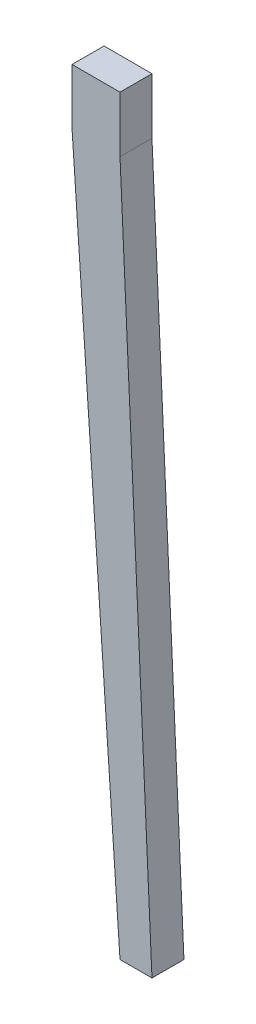
ISO-10303-21;
HEADER;
FILE_DESCRIPTION(('STEP AP214'),'2;1');
FILE_NAME('part.step','',(''),(''),'','','');
FILE_SCHEMA(('AUTOMOTIVE_DESIGN { 1 0 10303 214 1 1 1 1 }'));
ENDSEC;
DATA;
#1=APPLICATION_CONTEXT('core data for automotive mechanical design processes');
#2=APPLICATION_PROTOCOL_DEFINITION('international standard','automotive_design',2000,#1);
#3=PRODUCT_CONTEXT('',#1,'mechanical');
#4=PRODUCT('Part','Part','',(#3));
#5=PRODUCT_RELATED_PRODUCT_CATEGORY('part','',(#4));
#6=PRODUCT_DEFINITION_FORMATION('','',#4);
#7=PRODUCT_DEFINITION_CONTEXT('part definition',#1,'design');
#8=PRODUCT_DEFINITION('design','',#6,#7);
#9=PRODUCT_DEFINITION_SHAPE('','',#8);
#10=(LENGTH_UNIT() NAMED_UNIT(*) SI_UNIT(.MILLI.,.METRE.));
#11=(NAMED_UNIT(*) PLANE_ANGLE_UNIT() SI_UNIT($,.RADIAN.));
#12=(NAMED_UNIT(*) SI_UNIT($,.STERADIAN.) SOLID_ANGLE_UNIT());
#13=UNCERTAINTY_MEASURE_WITH_UNIT(LENGTH_MEASURE(1.E-05),#10,'distance_accuracy_value','');
#14=(GEOMETRIC_REPRESENTATION_CONTEXT(3) GLOBAL_UNCERTAINTY_ASSIGNED_CONTEXT((#13)) GLOBAL_UNIT_ASSIGNED_CONTEXT((#10,
#11,#12)) REPRESENTATION_CONTEXT('',''));
#15=CARTESIAN_POINT('',(0.,0.,0.));
#16=DIRECTION('',(0.,0.,1.));
#17=DIRECTION('',(1.,0.,0.));
#18=AXIS2_PLACEMENT_3D('',#15,#16,#17);
#19=CARTESIAN_POINT('',(38.1,0.,25.4));
#20=DIRECTION('',(1.,0.,0.));
#21=DIRECTION('',(0.,1.,0.));
#22=AXIS2_PLACEMENT_3D('',#19,#20,#21);
#23=PLANE('',#22);
#24=DIRECTION('',(0.,-1.,0.));
#25=VECTOR('',#24,1.);
#26=CARTESIAN_POINT('',(38.1,0.,0.));
#27=LINE('',#26,#25);
#28=CARTESIAN_POINT('',(38.1,0.,0.));
#29=VERTEX_POINT('',#28);
#30=CARTESIAN_POINT('',(38.1,-44.45,0.));
#31=VERTEX_POINT('',#30);
#32=EDGE_CURVE('E116',#29,#31,#27,.T.);
#33=ORIENTED_EDGE('',*,*,#32,.F.);
#34=DIRECTION('',(0.,0.,-1.));
#35=VECTOR('',#34,1.);
#36=CARTESIAN_POINT('',(38.1,0.,25.4));
#37=LINE('',#36,#35);
#38=CARTESIAN_POINT('',(38.1,0.,25.4));
#39=VERTEX_POINT('',#38);
#40=EDGE_CURVE('E11',#39,#29,#37,.T.);
#41=ORIENTED_EDGE('',*,*,#40,.F.);
#42=DIRECTION('',(0.,-1.,0.));
#43=VECTOR('',#42,1.);
#44=CARTESIAN_POINT('',(38.1,0.,25.4));
#45=LINE('',#44,#43);
#46=CARTESIAN_POINT('',(38.1,-44.45,25.4));
#47=VERTEX_POINT('',#46);
#48=EDGE_CURVE('E130',#39,#47,#45,.T.);
#49=ORIENTED_EDGE('',*,*,#48,.T.);
#50=DIRECTION('',(0.,0.,-1.));
#51=VECTOR('',#50,1.);
#52=CARTESIAN_POINT('',(38.1,-44.45,25.4));
#53=LINE('',#52,#51);
#54=EDGE_CURVE('E51',#47,#31,#53,.T.);
#55=ORIENTED_EDGE('',*,*,#54,.T.);
#56=EDGE_LOOP('',(#33,#41,#49,#55));
#57=FACE_BOUND('',#56,.T.);
#58=ADVANCED_FACE('F35',(#57),#23,.T.);
#59=CARTESIAN_POINT('',(0.,0.,25.4));
#60=DIRECTION('',(0.,1.,0.));
#61=DIRECTION('',(0.,0.,1.));
#62=AXIS2_PLACEMENT_3D('',#59,#60,#61);
#63=PLANE('',#62);
#64=DIRECTION('',(1.,0.,0.));
#65=VECTOR('',#64,1.);
#66=CARTESIAN_POINT('',(0.,0.,0.));
#67=LINE('',#66,#65);
#68=CARTESIAN_POINT('',(0.,0.,0.));
#69=VERTEX_POINT('',#68);
#70=EDGE_CURVE('E118',#69,#29,#67,.T.);
#71=ORIENTED_EDGE('',*,*,#70,.F.);
#72=DIRECTION('',(0.,0.,-1.));
#73=VECTOR('',#72,1.);
#74=CARTESIAN_POINT('',(0.,0.,25.4));
#75=LINE('',#74,#73);
#76=CARTESIAN_POINT('',(0.,0.,25.4));
#77=VERTEX_POINT('',#76);
#78=EDGE_CURVE('E43',#77,#69,#75,.T.);
#79=ORIENTED_EDGE('',*,*,#78,.F.);
#80=DIRECTION('',(1.,0.,0.));
#81=VECTOR('',#80,1.);
#82=CARTESIAN_POINT('',(0.,0.,25.4));
#83=LINE('',#82,#81);
#84=EDGE_CURVE('E142',#77,#39,#83,.T.);
#85=ORIENTED_EDGE('',*,*,#84,.T.);
#86=ORIENTED_EDGE('',*,*,#40,.T.);
#87=EDGE_LOOP('',(#71,#79,#85,#86));
#88=FACE_BOUND('',#87,.T.);
#89=ADVANCED_FACE('F141',(#88),#63,.T.);
#90=CARTESIAN_POINT('',(0.,0.,25.4));
#91=DIRECTION('',(1.,0.,0.));
#92=DIRECTION('',(0.,1.,0.));
#93=AXIS2_PLACEMENT_3D('',#90,#91,#92);
#94=PLANE('',#93);
#95=DIRECTION('',(0.,-1.,0.));
#96=VECTOR('',#95,1.);
#97=CARTESIAN_POINT('',(0.,0.,0.));
#98=LINE('',#97,#96);
#99=CARTESIAN_POINT('',(0.,-44.45,0.));
#100=VERTEX_POINT('',#99);
#101=EDGE_CURVE('E121',#69,#100,#98,.T.);
#102=ORIENTED_EDGE('',*,*,#101,.T.);
#103=DIRECTION('',(0.,0.,-1.));
#104=VECTOR('',#103,1.);
#105=CARTESIAN_POINT('',(0.,-44.45,25.4));
#106=LINE('',#105,#104);
#107=CARTESIAN_POINT('',(0.,-44.45,25.4));
#108=VERTEX_POINT('',#107);
#109=EDGE_CURVE('E98',#108,#100,#106,.T.);
#110=ORIENTED_EDGE('',*,*,#109,.F.);
#111=DIRECTION('',(0.,-1.,0.));
#112=VECTOR('',#111,1.);
#113=CARTESIAN_POINT('',(0.,0.,25.4));
#114=LINE('',#113,#112);
#115=EDGE_CURVE('E107',#77,#108,#114,.T.);
#116=ORIENTED_EDGE('',*,*,#115,.F.);
#117=ORIENTED_EDGE('',*,*,#78,.T.);
#118=EDGE_LOOP('',(#102,#110,#116,#117));
#119=FACE_BOUND('',#118,.T.);
#120=ADVANCED_FACE('F135',(#119),#94,.F.);
#121=CARTESIAN_POINT('',(-3.05100591715919,-0.210414201183353,25.4));
#122=DIRECTION('',(-0.997630328422984,-0.0688020916153654,0.));
#123=DIRECTION('',(0.0688020916153654,-0.997630328422984,0.));
#124=AXIS2_PLACEMENT_3D('',#121,#122,#123);
#125=PLANE('',#124);
#126=DIRECTION('',(-0.0688020916153654,0.997630328422984,0.));
#127=VECTOR('',#126,1.);
#128=CARTESIAN_POINT('',(-3.05100591715919,-0.210414201183353,0.));
#129=LINE('',#128,#127);
#130=CARTESIAN_POINT('',(38.0999999999929,-596.9,0.));
#131=VERTEX_POINT('',#130);
#132=EDGE_CURVE('E94',#131,#100,#129,.T.);
#133=ORIENTED_EDGE('',*,*,#132,.F.);
#134=DIRECTION('',(0.,0.,-1.));
#135=VECTOR('',#134,1.);
#136=CARTESIAN_POINT('',(38.0999999999929,-596.9,25.4));
#137=LINE('',#136,#135);
#138=CARTESIAN_POINT('',(38.0999999999929,-596.9,25.4));
#139=VERTEX_POINT('',#138);
#140=EDGE_CURVE('E89',#139,#131,#137,.T.);
#141=ORIENTED_EDGE('',*,*,#140,.F.);
#142=DIRECTION('',(-0.0688020916153654,0.997630328422984,0.));
#143=VECTOR('',#142,1.);
#144=CARTESIAN_POINT('',(-3.05100591715919,-0.210414201183353,25.4));
#145=LINE('',#144,#143);
#146=EDGE_CURVE('E92',#139,#108,#145,.T.);
#147=ORIENTED_EDGE('',*,*,#146,.T.);
#148=ORIENTED_EDGE('',*,*,#109,.T.);
#149=EDGE_LOOP('',(#133,#141,#147,#148));
#150=FACE_BOUND('',#149,.T.);
#151=ADVANCED_FACE('F91',(#150),#125,.T.);
#152=CARTESIAN_POINT('',(0.,-596.9,25.4));
#153=DIRECTION('',(0.,-1.,0.));
#154=DIRECTION('',(0.,0.,-1.));
#155=AXIS2_PLACEMENT_3D('',#152,#153,#154);
#156=PLANE('',#155);
#157=DIRECTION('',(-1.,0.,0.));
#158=VECTOR('',#157,1.);
#159=CARTESIAN_POINT('',(0.,-596.9,0.));
#160=LINE('',#159,#158);
#161=CARTESIAN_POINT('',(63.5,-596.9,0.));
#162=VERTEX_POINT('',#161);
#163=EDGE_CURVE('E125',#162,#131,#160,.T.);
#164=ORIENTED_EDGE('',*,*,#163,.F.);
#165=DIRECTION('',(0.,0.,-1.));
#166=VECTOR('',#165,1.);
#167=CARTESIAN_POINT('',(63.5,-596.9,25.4));
#168=LINE('',#167,#166);
#169=CARTESIAN_POINT('',(63.5,-596.9,25.4));
#170=VERTEX_POINT('',#169);
#171=EDGE_CURVE('E70',#170,#162,#168,.T.);
#172=ORIENTED_EDGE('',*,*,#171,.F.);
#173=DIRECTION('',(-1.,0.,0.));
#174=VECTOR('',#173,1.);
#175=CARTESIAN_POINT('',(0.,-596.9,25.4));
#176=LINE('',#175,#174);
#177=EDGE_CURVE('E104',#170,#139,#176,.T.);
#178=ORIENTED_EDGE('',*,*,#177,.T.);
#179=ORIENTED_EDGE('',*,*,#140,.T.);
#180=EDGE_LOOP('',(#164,#172,#178,#179));
#181=FACE_BOUND('',#180,.T.);
#182=ADVANCED_FACE('F110',(#181),#156,.T.);
#183=CARTESIAN_POINT('',(35.9802636783125,1.65426499670402,25.4));
#184=DIRECTION('',(0.998944729952728,0.0459284933311599,0.));
#185=DIRECTION('',(-0.0459284933311599,0.998944729952729,0.));
#186=AXIS2_PLACEMENT_3D('',#183,#184,#185);
#187=PLANE('',#186);
#188=DIRECTION('',(0.0459284933311599,-0.998944729952729,0.));
#189=VECTOR('',#188,1.);
#190=CARTESIAN_POINT('',(35.9802636783125,1.65426499670402,0.));
#191=LINE('',#190,#189);
#192=EDGE_CURVE('E127',#31,#162,#191,.T.);
#193=ORIENTED_EDGE('',*,*,#192,.F.);
#194=ORIENTED_EDGE('',*,*,#54,.F.);
#195=DIRECTION('',(0.0459284933311599,-0.998944729952729,0.));
#196=VECTOR('',#195,1.);
#197=CARTESIAN_POINT('',(35.9802636783125,1.65426499670402,25.4));
#198=LINE('',#197,#196);
#199=EDGE_CURVE('E111',#47,#170,#198,.T.);
#200=ORIENTED_EDGE('',*,*,#199,.T.);
#201=ORIENTED_EDGE('',*,*,#171,.T.);
#202=EDGE_LOOP('',(#193,#194,#200,#201));
#203=FACE_BOUND('',#202,.T.);
#204=ADVANCED_FACE('F143',(#203),#187,.T.);
#205=CARTESIAN_POINT('',(0.,0.,25.4));
#206=DIRECTION('',(0.,0.,1.));
#207=DIRECTION('',(1.,0.,0.));
#208=AXIS2_PLACEMENT_3D('',#205,#206,#207);
#209=PLANE('',#208);
#210=ORIENTED_EDGE('',*,*,#48,.F.);
#211=ORIENTED_EDGE('',*,*,#84,.F.);
#212=ORIENTED_EDGE('',*,*,#115,.T.);
#213=ORIENTED_EDGE('',*,*,#146,.F.);
#214=ORIENTED_EDGE('',*,*,#177,.F.);
#215=ORIENTED_EDGE('',*,*,#199,.F.);
#216=EDGE_LOOP('',(#210,#211,#212,#213,#214,#215));
#217=FACE_BOUND('',#216,.T.);
#218=ADVANCED_FACE('F102',(#217),#209,.T.);
#219=CARTESIAN_POINT('',(0.,0.,0.));
#220=DIRECTION('',(0.,0.,1.));
#221=DIRECTION('',(1.,0.,0.));
#222=AXIS2_PLACEMENT_3D('',#219,#220,#221);
#223=PLANE('',#222);
#224=ORIENTED_EDGE('',*,*,#32,.T.);
#225=ORIENTED_EDGE('',*,*,#192,.T.);
#226=ORIENTED_EDGE('',*,*,#163,.T.);
#227=ORIENTED_EDGE('',*,*,#132,.T.);
#228=ORIENTED_EDGE('',*,*,#101,.F.);
#229=ORIENTED_EDGE('',*,*,#70,.T.);
#230=EDGE_LOOP('',(#224,#225,#226,#227,#228,#229));
#231=FACE_BOUND('',#230,.T.);
#232=ADVANCED_FACE('F140',(#231),#223,.F.);
#233=CLOSED_SHELL('',(#58,#89,#120,#151,#182,#204,#218,#232));
#234=MANIFOLD_SOLID_BREP('B2',#233);
#235=ADVANCED_BREP_SHAPE_REPRESENTATION('',(#18,#234),#14);
#236=SHAPE_DEFINITION_REPRESENTATION(#9,#235);
ENDSEC;
END-ISO-10303-21;
